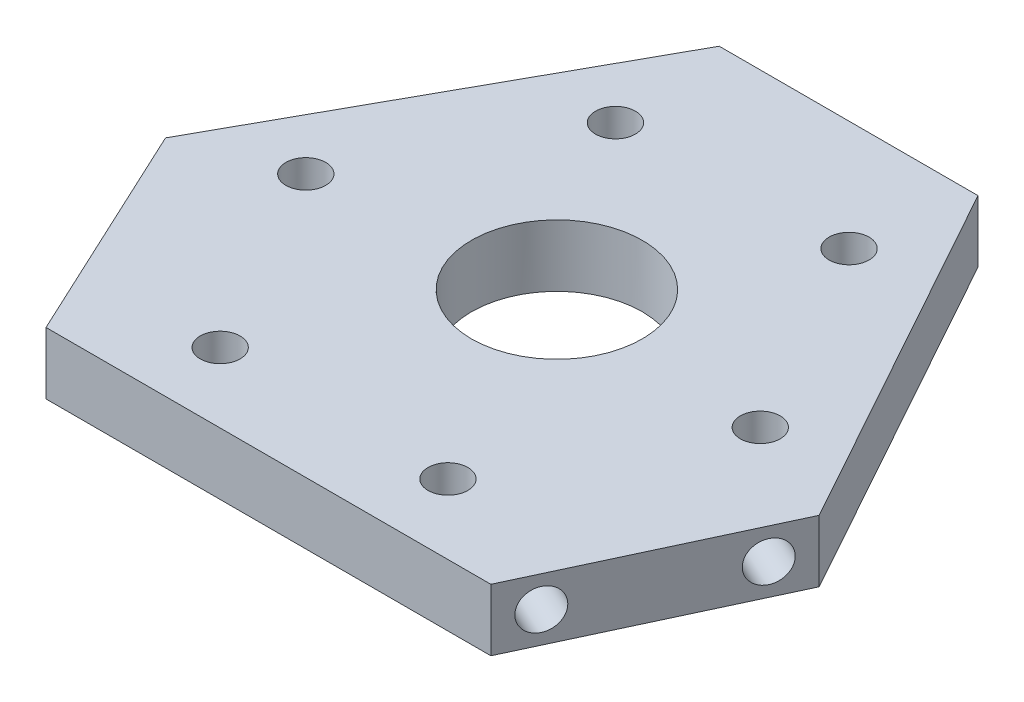
ISO-10303-21;
HEADER;
FILE_DESCRIPTION(('STEP AP214'),'2;1');
FILE_NAME('part.step','',(''),(''),'','','');
FILE_SCHEMA(('AUTOMOTIVE_DESIGN { 1 0 10303 214 1 1 1 1 }'));
ENDSEC;
DATA;
#1=APPLICATION_CONTEXT('core data for automotive mechanical design processes');
#2=APPLICATION_PROTOCOL_DEFINITION('international standard','automotive_design',2000,#1);
#3=PRODUCT_CONTEXT('',#1,'mechanical');
#4=PRODUCT('Part','Part','',(#3));
#5=PRODUCT_RELATED_PRODUCT_CATEGORY('part','',(#4));
#6=PRODUCT_DEFINITION_FORMATION('','',#4);
#7=PRODUCT_DEFINITION_CONTEXT('part definition',#1,'design');
#8=PRODUCT_DEFINITION('design','',#6,#7);
#9=PRODUCT_DEFINITION_SHAPE('','',#8);
#10=(LENGTH_UNIT() NAMED_UNIT(*) SI_UNIT(.MILLI.,.METRE.));
#11=(NAMED_UNIT(*) PLANE_ANGLE_UNIT() SI_UNIT($,.RADIAN.));
#12=(NAMED_UNIT(*) SI_UNIT($,.STERADIAN.) SOLID_ANGLE_UNIT());
#13=UNCERTAINTY_MEASURE_WITH_UNIT(LENGTH_MEASURE(1.E-05),#10,'distance_accuracy_value','');
#14=(GEOMETRIC_REPRESENTATION_CONTEXT(3) GLOBAL_UNCERTAINTY_ASSIGNED_CONTEXT((#13)) GLOBAL_UNIT_ASSIGNED_CONTEXT((#10,
#11,#12)) REPRESENTATION_CONTEXT('',''));
#15=CARTESIAN_POINT('',(0.,0.,0.));
#16=DIRECTION('',(0.,0.,1.));
#17=DIRECTION('',(1.,0.,0.));
#18=AXIS2_PLACEMENT_3D('',#15,#16,#17);
#19=CARTESIAN_POINT('',(6.10164723280824,6.0125,-4.93706927111017));
#20=DIRECTION('',(0.906307787036648,0.,-0.422618261740704));
#21=DIRECTION('',(-0.422618261740704,0.,-0.906307787036648));
#22=AXIS2_PLACEMENT_3D('',#19,#20,#21);
#23=PLANE('',#22);
#24=CARTESIAN_POINT('',(4.41117418584543,3.2525,-8.56230041925676));
#25=DIRECTION('',(-0.906307787036648,0.,0.422618261740704));
#26=DIRECTION('',(0.422618261740704,0.,0.906307787036648));
#27=AXIS2_PLACEMENT_3D('',#24,#25,#26);
#28=CIRCLE('',#27,2.1);
#29=CARTESIAN_POINT('',(5.29867253550091,3.2525,-6.6590540664798));
#30=VERTEX_POINT('',#29);
#31=EDGE_CURVE('E182',#30,#30,#28,.T.);
#32=ORIENTED_EDGE('',*,*,#31,.F.);
#33=EDGE_LOOP('',(#32));
#34=FACE_BOUND('',#33,.T.);
#35=CARTESIAN_POINT('',(-3.21045183401008,3.2525,-24.9069301643724));
#36=DIRECTION('',(-0.906307787036648,0.,0.422618261740704));
#37=DIRECTION('',(0.422618261740704,0.,0.906307787036648));
#38=AXIS2_PLACEMENT_3D('',#35,#36,#37);
#39=CIRCLE('',#38,2.1);
#40=CARTESIAN_POINT('',(-2.3229534843546,3.2525,-23.0036838115955));
#41=VERTEX_POINT('',#40);
#42=EDGE_CURVE('E188',#41,#41,#39,.T.);
#43=ORIENTED_EDGE('',*,*,#42,.F.);
#44=EDGE_LOOP('',(#43));
#45=FACE_BOUND('',#44,.T.);
#46=DIRECTION('',(0.,-1.,0.));
#47=VECTOR('',#46,1.);
#48=CARTESIAN_POINT('',(-4.9009248809729,6.0125,-28.532161312519));
#49=LINE('',#48,#47);
#50=CARTESIAN_POINT('',(-4.9009248809729,6.5125,-28.532161312519));
#51=VERTEX_POINT('',#50);
#52=CARTESIAN_POINT('',(-4.9009248809729,-0.0125000000000001,-28.532161312519));
#53=VERTEX_POINT('',#52);
#54=EDGE_CURVE('E100',#51,#53,#49,.T.);
#55=ORIENTED_EDGE('',*,*,#54,.T.);
#56=DIRECTION('',(-0.422618261740704,0.,-0.906307787036648));
#57=VECTOR('',#56,1.);
#58=CARTESIAN_POINT('',(6.10164723280824,-0.0125000000000001,-4.93706927111017));
#59=LINE('',#58,#57);
#60=CARTESIAN_POINT('',(6.10164723280824,-0.0125000000000001,-4.93706927111017));
#61=VERTEX_POINT('',#60);
#62=EDGE_CURVE('E99',#61,#53,#59,.T.);
#63=ORIENTED_EDGE('',*,*,#62,.F.);
#64=DIRECTION('',(0.,-1.,0.));
#65=VECTOR('',#64,1.);
#66=CARTESIAN_POINT('',(6.10164723280824,6.0125,-4.93706927111017));
#67=LINE('',#66,#65);
#68=CARTESIAN_POINT('',(6.10164723280824,6.5125,-4.93706927111017));
#69=VERTEX_POINT('',#68);
#70=EDGE_CURVE('E11',#69,#61,#67,.T.);
#71=ORIENTED_EDGE('',*,*,#70,.F.);
#72=DIRECTION('',(0.422618261740704,0.,0.906307787036648));
#73=VECTOR('',#72,1.);
#74=CARTESIAN_POINT('',(-4.9009248809729,6.5125,-28.532161312519));
#75=LINE('',#74,#73);
#76=EDGE_CURVE('E150',#51,#69,#75,.T.);
#77=ORIENTED_EDGE('',*,*,#76,.F.);
#78=EDGE_LOOP('',(#55,#63,#71,#77));
#79=FACE_BOUND('',#78,.T.);
#80=ADVANCED_FACE('F36',(#34,#45,#79),#23,.F.);
#81=CARTESIAN_POINT('',(6.10164723280824,6.0125,-4.93706927111017));
#82=DIRECTION('',(0.,0.,-1.));
#83=DIRECTION('',(-1.,0.,0.));
#84=AXIS2_PLACEMENT_3D('',#81,#82,#83);
#85=PLANE('',#84);
#86=ORIENTED_EDGE('',*,*,#70,.T.);
#87=DIRECTION('',(-1.,0.,0.));
#88=VECTOR('',#87,1.);
#89=CARTESIAN_POINT('',(52.9754566450042,-0.0125000000000001,-4.93706927111017));
#90=LINE('',#89,#88);
#91=CARTESIAN_POINT('',(52.9754566450042,-0.0125000000000001,-4.93706927111017));
#92=VERTEX_POINT('',#91);
#93=EDGE_CURVE('E92',#92,#61,#90,.T.);
#94=ORIENTED_EDGE('',*,*,#93,.F.);
#95=DIRECTION('',(0.,-1.,0.));
#96=VECTOR('',#95,1.);
#97=CARTESIAN_POINT('',(52.9754566450042,6.0125,-4.93706927111017));
#98=LINE('',#97,#96);
#99=CARTESIAN_POINT('',(52.9754566450042,6.5125,-4.93706927111017));
#100=VERTEX_POINT('',#99);
#101=EDGE_CURVE('E43',#100,#92,#98,.T.);
#102=ORIENTED_EDGE('',*,*,#101,.F.);
#103=DIRECTION('',(1.,0.,0.));
#104=VECTOR('',#103,1.);
#105=CARTESIAN_POINT('',(6.10164723280824,6.5125,-4.93706927111017));
#106=LINE('',#105,#104);
#107=EDGE_CURVE('E94',#69,#100,#106,.T.);
#108=ORIENTED_EDGE('',*,*,#107,.F.);
#109=EDGE_LOOP('',(#86,#94,#102,#108));
#110=FACE_BOUND('',#109,.T.);
#111=ADVANCED_FACE('F90',(#110),#85,.F.);
#112=CARTESIAN_POINT('',(52.9754566450042,6.0125,-4.93706927111017));
#113=DIRECTION('',(-0.906307787036648,0.,-0.422618261740704));
#114=DIRECTION('',(-0.422618261740704,0.,0.906307787036648));
#115=AXIS2_PLACEMENT_3D('',#112,#113,#114);
#116=PLANE('',#115);
#117=CARTESIAN_POINT('',(62.2875557118226,3.2525,-24.9069301643724));
#118=DIRECTION('',(0.906307787036648,0.,0.422618261740704));
#119=DIRECTION('',(0.422618261740704,0.,-0.906307787036648));
#120=AXIS2_PLACEMENT_3D('',#117,#118,#119);
#121=CIRCLE('',#120,2.1);
#122=CARTESIAN_POINT('',(63.1750540614781,3.2525,-26.8101765171494));
#123=VERTEX_POINT('',#122);
#124=EDGE_CURVE('E160',#123,#123,#121,.T.);
#125=ORIENTED_EDGE('',*,*,#124,.F.);
#126=EDGE_LOOP('',(#125));
#127=FACE_BOUND('',#126,.T.);
#128=CARTESIAN_POINT('',(54.6659296919671,3.2525,-8.56230041925675));
#129=DIRECTION('',(0.906307787036648,0.,0.422618261740704));
#130=DIRECTION('',(0.422618261740704,0.,-0.906307787036648));
#131=AXIS2_PLACEMENT_3D('',#128,#129,#130);
#132=CIRCLE('',#131,2.09999999999998);
#133=CARTESIAN_POINT('',(55.5534280416225,3.2525,-10.4655467720337));
#134=VERTEX_POINT('',#133);
#135=EDGE_CURVE('E164',#134,#134,#132,.T.);
#136=ORIENTED_EDGE('',*,*,#135,.F.);
#137=EDGE_LOOP('',(#136));
#138=FACE_BOUND('',#137,.T.);
#139=ORIENTED_EDGE('',*,*,#101,.T.);
#140=DIRECTION('',(-0.422618261740704,0.,0.906307787036648));
#141=VECTOR('',#140,1.);
#142=CARTESIAN_POINT('',(63.9780287587854,-0.0125000000000001,-28.532161312519));
#143=LINE('',#142,#141);
#144=CARTESIAN_POINT('',(63.9780287587854,-0.0125000000000001,-28.532161312519));
#145=VERTEX_POINT('',#144);
#146=EDGE_CURVE('E111',#145,#92,#143,.T.);
#147=ORIENTED_EDGE('',*,*,#146,.F.);
#148=DIRECTION('',(0.,-1.,0.));
#149=VECTOR('',#148,1.);
#150=CARTESIAN_POINT('',(63.9780287587854,6.0125,-28.532161312519));
#151=LINE('',#150,#149);
#152=CARTESIAN_POINT('',(63.9780287587854,6.5125,-28.532161312519));
#153=VERTEX_POINT('',#152);
#154=EDGE_CURVE('E199',#153,#145,#151,.T.);
#155=ORIENTED_EDGE('',*,*,#154,.F.);
#156=DIRECTION('',(0.422618261740704,0.,-0.906307787036648));
#157=VECTOR('',#156,1.);
#158=CARTESIAN_POINT('',(52.9754566450042,6.5125,-4.93706927111017));
#159=LINE('',#158,#157);
#160=EDGE_CURVE('E153',#100,#153,#159,.T.);
#161=ORIENTED_EDGE('',*,*,#160,.F.);
#162=EDGE_LOOP('',(#139,#147,#155,#161));
#163=FACE_BOUND('',#162,.T.);
#164=ADVANCED_FACE('F202',(#127,#138,#163),#116,.F.);
#165=CARTESIAN_POINT('',(43.1715833101727,6.0125,-66.0679825192663));
#166=DIRECTION('',(-0.874619707139397,0.,0.484809620246335));
#167=DIRECTION('',(0.484809620246335,0.,0.874619707139397));
#168=AXIS2_PLACEMENT_3D('',#165,#166,#167);
#169=PLANE('',#168);
#170=ORIENTED_EDGE('',*,*,#154,.T.);
#171=DIRECTION('',(0.484809620246335,0.,0.874619707139397));
#172=VECTOR('',#171,1.);
#173=CARTESIAN_POINT('',(43.1715833101727,-0.0125000000000001,-66.0679825192663));
#174=LINE('',#173,#172);
#175=CARTESIAN_POINT('',(43.1715833101727,-0.0125000000000001,-66.0679825192663));
#176=VERTEX_POINT('',#175);
#177=EDGE_CURVE('E123',#176,#145,#174,.T.);
#178=ORIENTED_EDGE('',*,*,#177,.F.);
#179=DIRECTION('',(0.,-1.,0.));
#180=VECTOR('',#179,1.);
#181=CARTESIAN_POINT('',(43.1715833101727,6.0125,-66.0679825192663));
#182=LINE('',#181,#180);
#183=CARTESIAN_POINT('',(43.1715833101727,6.5125,-66.0679825192663));
#184=VERTEX_POINT('',#183);
#185=EDGE_CURVE('E58',#184,#176,#182,.T.);
#186=ORIENTED_EDGE('',*,*,#185,.F.);
#187=DIRECTION('',(-0.484809620246335,0.,-0.874619707139397));
#188=VECTOR('',#187,1.);
#189=CARTESIAN_POINT('',(63.9780287587854,6.5125,-28.532161312519));
#190=LINE('',#189,#188);
#191=EDGE_CURVE('E156',#153,#184,#190,.T.);
#192=ORIENTED_EDGE('',*,*,#191,.F.);
#193=EDGE_LOOP('',(#170,#178,#186,#192));
#194=FACE_BOUND('',#193,.T.);
#195=ADVANCED_FACE('F211',(#194),#169,.F.);
#196=CARTESIAN_POINT('',(15.9055205676398,6.0125,-66.0679825192663));
#197=DIRECTION('',(0.,0.,1.));
#198=DIRECTION('',(1.,0.,0.));
#199=AXIS2_PLACEMENT_3D('',#196,#197,#198);
#200=PLANE('',#199);
#201=CARTESIAN_POINT('',(19.9055205676398,3.2525,-66.0679825192663));
#202=DIRECTION('',(0.,0.,-1.));
#203=DIRECTION('',(-1.,0.,0.));
#204=AXIS2_PLACEMENT_3D('',#201,#202,#203);
#205=CIRCLE('',#204,2.1);
#206=CARTESIAN_POINT('',(17.8055205676398,3.2525,-66.0679825192663));
#207=VERTEX_POINT('',#206);
#208=EDGE_CURVE('E170',#207,#207,#205,.T.);
#209=ORIENTED_EDGE('',*,*,#208,.F.);
#210=EDGE_LOOP('',(#209));
#211=FACE_BOUND('',#210,.T.);
#212=CARTESIAN_POINT('',(39.1715833101727,3.2525,-66.0679825192663));
#213=DIRECTION('',(0.,0.,-1.));
#214=DIRECTION('',(-1.,0.,0.));
#215=AXIS2_PLACEMENT_3D('',#212,#213,#214);
#216=CIRCLE('',#215,2.1);
#217=CARTESIAN_POINT('',(37.0715833101727,3.2525,-66.0679825192663));
#218=VERTEX_POINT('',#217);
#219=EDGE_CURVE('E176',#218,#218,#216,.T.);
#220=ORIENTED_EDGE('',*,*,#219,.F.);
#221=EDGE_LOOP('',(#220));
#222=FACE_BOUND('',#221,.T.);
#223=ORIENTED_EDGE('',*,*,#185,.T.);
#224=DIRECTION('',(1.,0.,0.));
#225=VECTOR('',#224,1.);
#226=CARTESIAN_POINT('',(15.9055205676398,-0.0125000000000001,-66.0679825192663));
#227=LINE('',#226,#225);
#228=CARTESIAN_POINT('',(15.9055205676398,-0.0125000000000001,-66.0679825192663));
#229=VERTEX_POINT('',#228);
#230=EDGE_CURVE('E120',#229,#176,#227,.T.);
#231=ORIENTED_EDGE('',*,*,#230,.F.);
#232=DIRECTION('',(0.,-1.,0.));
#233=VECTOR('',#232,1.);
#234=CARTESIAN_POINT('',(15.9055205676398,6.0125,-66.0679825192663));
#235=LINE('',#234,#233);
#236=CARTESIAN_POINT('',(15.9055205676398,6.5125,-66.0679825192663));
#237=VERTEX_POINT('',#236);
#238=EDGE_CURVE('E50',#237,#229,#235,.T.);
#239=ORIENTED_EDGE('',*,*,#238,.F.);
#240=DIRECTION('',(-1.,0.,0.));
#241=VECTOR('',#240,1.);
#242=CARTESIAN_POINT('',(43.1715833101727,6.5125,-66.0679825192663));
#243=LINE('',#242,#241);
#244=EDGE_CURVE('E158',#184,#237,#243,.T.);
#245=ORIENTED_EDGE('',*,*,#244,.F.);
#246=EDGE_LOOP('',(#223,#231,#239,#245));
#247=FACE_BOUND('',#246,.T.);
#248=ADVANCED_FACE('F209',(#211,#222,#247),#200,.F.);
#249=CARTESIAN_POINT('',(-4.9009248809729,6.0125,-28.532161312519));
#250=DIRECTION('',(0.874619707139397,0.,0.484809620246335));
#251=DIRECTION('',(0.484809620246335,0.,-0.874619707139397));
#252=AXIS2_PLACEMENT_3D('',#249,#250,#251);
#253=PLANE('',#252);
#254=ORIENTED_EDGE('',*,*,#238,.T.);
#255=DIRECTION('',(0.484809620246335,0.,-0.874619707139397));
#256=VECTOR('',#255,1.);
#257=CARTESIAN_POINT('',(-4.9009248809729,-0.0125000000000001,-28.532161312519));
#258=LINE('',#257,#256);
#259=EDGE_CURVE('E104',#53,#229,#258,.T.);
#260=ORIENTED_EDGE('',*,*,#259,.F.);
#261=ORIENTED_EDGE('',*,*,#54,.F.);
#262=DIRECTION('',(-0.484809620246335,0.,0.874619707139397));
#263=VECTOR('',#262,1.);
#264=CARTESIAN_POINT('',(15.9055205676398,6.5125,-66.0679825192663));
#265=LINE('',#264,#263);
#266=EDGE_CURVE('E147',#237,#51,#265,.T.);
#267=ORIENTED_EDGE('',*,*,#266,.F.);
#268=EDGE_LOOP('',(#254,#260,#261,#267));
#269=FACE_BOUND('',#268,.T.);
#270=ADVANCED_FACE('F208',(#269),#253,.F.);
#271=CARTESIAN_POINT('',(29.5610287587854,-3.9875,-35.3073480142442));
#272=DIRECTION('',(0.,1.,0.));
#273=DIRECTION('',(0.,0.,1.));
#274=AXIS2_PLACEMENT_3D('',#271,#272,#273);
#275=CYLINDRICAL_SURFACE('',#274,9.);
#276=CARTESIAN_POINT('',(29.5610287587854,6.5125,-35.3073480142442));
#277=DIRECTION('',(0.,1.,0.));
#278=DIRECTION('',(0.,0.,1.));
#279=AXIS2_PLACEMENT_3D('',#276,#277,#278);
#280=CIRCLE('',#279,9.);
#281=CARTESIAN_POINT('',(29.5610287587854,6.5125,-26.3073480142442));
#282=VERTEX_POINT('',#281);
#283=EDGE_CURVE('E138',#282,#282,#280,.T.);
#284=ORIENTED_EDGE('',*,*,#283,.T.);
#285=EDGE_LOOP('',(#284));
#286=FACE_BOUND('',#285,.T.);
#287=CARTESIAN_POINT('',(29.5610287587854,-0.0125000000000001,-35.3073480142442));
#288=DIRECTION('',(0.,-1.,0.));
#289=DIRECTION('',(0.,0.,-1.));
#290=AXIS2_PLACEMENT_3D('',#287,#288,#289);
#291=CIRCLE('',#290,9.);
#292=CARTESIAN_POINT('',(29.5610287587854,-0.0125000000000001,-44.3073480142442));
#293=VERTEX_POINT('',#292);
#294=EDGE_CURVE('E334',#293,#293,#291,.T.);
#295=ORIENTED_EDGE('',*,*,#294,.T.);
#296=EDGE_LOOP('',(#295));
#297=FACE_BOUND('',#296,.T.);
#298=ADVANCED_FACE('F218',(#286,#297),#275,.F.);
#299=CARTESIAN_POINT('',(2.2273948882098,3.2525,-27.4426397348166));
#300=DIRECTION('',(-0.906307787036648,0.,0.422618261740704));
#301=DIRECTION('',(0.422618261740704,0.,0.906307787036648));
#302=AXIS2_PLACEMENT_3D('',#299,#300,#301);
#303=CYLINDRICAL_SURFACE('',#302,2.1);
#304=CARTESIAN_POINT('',(2.2273948882098,3.2525,-27.4426397348166));
#305=DIRECTION('',(-0.906307787036648,0.,0.422618261740704));
#306=DIRECTION('',(0.422618261740704,0.,0.906307787036648));
#307=AXIS2_PLACEMENT_3D('',#304,#305,#306);
#308=CIRCLE('',#307,2.1);
#309=CARTESIAN_POINT('',(3.11489323786528,3.2525,-25.5393933820397));
#310=VERTEX_POINT('',#309);
#311=EDGE_CURVE('E191',#310,#310,#308,.T.);
#312=ORIENTED_EDGE('',*,*,#311,.F.);
#313=EDGE_LOOP('',(#312));
#314=FACE_BOUND('',#313,.T.);
#315=ORIENTED_EDGE('',*,*,#42,.T.);
#316=EDGE_LOOP('',(#315));
#317=FACE_BOUND('',#316,.T.);
#318=ADVANCED_FACE('F232',(#314,#317),#303,.F.);
#319=CARTESIAN_POINT('',(2.2273948882098,3.2525,-27.4426397348166));
#320=DIRECTION('',(-0.906307787036648,0.,0.422618261740704));
#321=DIRECTION('',(0.422618261740704,0.,0.906307787036648));
#322=AXIS2_PLACEMENT_3D('',#319,#320,#321);
#323=PLANE('',#322);
#324=ORIENTED_EDGE('',*,*,#311,.T.);
#325=EDGE_LOOP('',(#324));
#326=FACE_BOUND('',#325,.T.);
#327=ADVANCED_FACE('F234',(#326),#323,.T.);
#328=CARTESIAN_POINT('',(9.84902090806531,3.2525,-11.098009989701));
#329=DIRECTION('',(-0.906307787036648,0.,0.422618261740704));
#330=DIRECTION('',(0.422618261740704,0.,0.906307787036648));
#331=AXIS2_PLACEMENT_3D('',#328,#329,#330);
#332=CYLINDRICAL_SURFACE('',#331,2.1);
#333=CARTESIAN_POINT('',(9.84902090806531,3.2525,-11.098009989701));
#334=DIRECTION('',(-0.906307787036648,0.,0.422618261740704));
#335=DIRECTION('',(0.422618261740704,0.,0.906307787036648));
#336=AXIS2_PLACEMENT_3D('',#333,#334,#335);
#337=CIRCLE('',#336,2.1);
#338=CARTESIAN_POINT('',(10.7365192577208,3.2525,-9.19476363692402));
#339=VERTEX_POINT('',#338);
#340=EDGE_CURVE('E185',#339,#339,#337,.T.);
#341=ORIENTED_EDGE('',*,*,#340,.F.);
#342=EDGE_LOOP('',(#341));
#343=FACE_BOUND('',#342,.T.);
#344=ORIENTED_EDGE('',*,*,#31,.T.);
#345=EDGE_LOOP('',(#344));
#346=FACE_BOUND('',#345,.T.);
#347=ADVANCED_FACE('F241',(#343,#346),#332,.F.);
#348=CARTESIAN_POINT('',(9.84902090806531,3.2525,-11.098009989701));
#349=DIRECTION('',(-0.906307787036648,0.,0.422618261740704));
#350=DIRECTION('',(0.422618261740704,0.,0.906307787036648));
#351=AXIS2_PLACEMENT_3D('',#348,#349,#350);
#352=PLANE('',#351);
#353=ORIENTED_EDGE('',*,*,#340,.T.);
#354=EDGE_LOOP('',(#353));
#355=FACE_BOUND('',#354,.T.);
#356=ADVANCED_FACE('F250',(#355),#352,.T.);
#357=CARTESIAN_POINT('',(39.1715833101727,3.2525,-60.0679825192663));
#358=DIRECTION('',(0.,0.,-1.));
#359=DIRECTION('',(-1.,0.,0.));
#360=AXIS2_PLACEMENT_3D('',#357,#358,#359);
#361=CYLINDRICAL_SURFACE('',#360,2.1);
#362=CARTESIAN_POINT('',(39.1715833101727,3.2525,-60.0679825192663));
#363=DIRECTION('',(0.,0.,-1.));
#364=DIRECTION('',(-1.,0.,0.));
#365=AXIS2_PLACEMENT_3D('',#362,#363,#364);
#366=CIRCLE('',#365,2.1);
#367=CARTESIAN_POINT('',(37.0715833101727,3.2525,-60.0679825192663));
#368=VERTEX_POINT('',#367);
#369=EDGE_CURVE('E179',#368,#368,#366,.T.);
#370=ORIENTED_EDGE('',*,*,#369,.F.);
#371=EDGE_LOOP('',(#370));
#372=FACE_BOUND('',#371,.T.);
#373=ORIENTED_EDGE('',*,*,#219,.T.);
#374=EDGE_LOOP('',(#373));
#375=FACE_BOUND('',#374,.T.);
#376=ADVANCED_FACE('F254',(#372,#375),#361,.F.);
#377=CARTESIAN_POINT('',(39.1715833101727,3.2525,-60.0679825192663));
#378=DIRECTION('',(0.,0.,-1.));
#379=DIRECTION('',(-1.,0.,0.));
#380=AXIS2_PLACEMENT_3D('',#377,#378,#379);
#381=PLANE('',#380);
#382=ORIENTED_EDGE('',*,*,#369,.T.);
#383=EDGE_LOOP('',(#382));
#384=FACE_BOUND('',#383,.T.);
#385=ADVANCED_FACE('F258',(#384),#381,.T.);
#386=CARTESIAN_POINT('',(19.9055205676398,3.2525,-60.0679825192663));
#387=DIRECTION('',(0.,0.,-1.));
#388=DIRECTION('',(-1.,0.,0.));
#389=AXIS2_PLACEMENT_3D('',#386,#387,#388);
#390=CYLINDRICAL_SURFACE('',#389,2.1);
#391=CARTESIAN_POINT('',(19.9055205676398,3.2525,-60.0679825192663));
#392=DIRECTION('',(0.,0.,-1.));
#393=DIRECTION('',(-1.,0.,0.));
#394=AXIS2_PLACEMENT_3D('',#391,#392,#393);
#395=CIRCLE('',#394,2.1);
#396=CARTESIAN_POINT('',(17.8055205676398,3.2525,-60.0679825192663));
#397=VERTEX_POINT('',#396);
#398=EDGE_CURVE('E173',#397,#397,#395,.T.);
#399=ORIENTED_EDGE('',*,*,#398,.F.);
#400=EDGE_LOOP('',(#399));
#401=FACE_BOUND('',#400,.T.);
#402=ORIENTED_EDGE('',*,*,#208,.T.);
#403=EDGE_LOOP('',(#402));
#404=FACE_BOUND('',#403,.T.);
#405=ADVANCED_FACE('F262',(#401,#404),#390,.F.);
#406=CARTESIAN_POINT('',(19.9055205676398,3.2525,-60.0679825192663));
#407=DIRECTION('',(0.,0.,-1.));
#408=DIRECTION('',(-1.,0.,0.));
#409=AXIS2_PLACEMENT_3D('',#406,#407,#408);
#410=PLANE('',#409);
#411=ORIENTED_EDGE('',*,*,#398,.T.);
#412=EDGE_LOOP('',(#411));
#413=FACE_BOUND('',#412,.T.);
#414=ADVANCED_FACE('F266',(#413),#410,.T.);
#415=CARTESIAN_POINT('',(49.2280829697472,3.2525,-11.098009989701));
#416=DIRECTION('',(0.906307787036648,0.,0.422618261740704));
#417=DIRECTION('',(0.422618261740704,0.,-0.906307787036648));
#418=AXIS2_PLACEMENT_3D('',#415,#416,#417);
#419=CYLINDRICAL_SURFACE('',#418,2.09999999999998);
#420=CARTESIAN_POINT('',(49.2280829697472,3.2525,-11.098009989701));
#421=DIRECTION('',(0.906307787036648,0.,0.422618261740704));
#422=DIRECTION('',(0.422618261740704,0.,-0.906307787036648));
#423=AXIS2_PLACEMENT_3D('',#420,#421,#422);
#424=CIRCLE('',#423,2.09999999999998);
#425=CARTESIAN_POINT('',(50.1155813194027,3.2525,-13.0012563424779));
#426=VERTEX_POINT('',#425);
#427=EDGE_CURVE('E167',#426,#426,#424,.T.);
#428=ORIENTED_EDGE('',*,*,#427,.F.);
#429=EDGE_LOOP('',(#428));
#430=FACE_BOUND('',#429,.T.);
#431=ORIENTED_EDGE('',*,*,#135,.T.);
#432=EDGE_LOOP('',(#431));
#433=FACE_BOUND('',#432,.T.);
#434=ADVANCED_FACE('F270',(#430,#433),#419,.F.);
#435=CARTESIAN_POINT('',(49.2280829697472,3.2525,-11.098009989701));
#436=DIRECTION('',(0.906307787036648,0.,0.422618261740704));
#437=DIRECTION('',(0.422618261740704,0.,-0.906307787036648));
#438=AXIS2_PLACEMENT_3D('',#435,#436,#437);
#439=PLANE('',#438);
#440=ORIENTED_EDGE('',*,*,#427,.T.);
#441=EDGE_LOOP('',(#440));
#442=FACE_BOUND('',#441,.T.);
#443=ADVANCED_FACE('F274',(#442),#439,.T.);
#444=CARTESIAN_POINT('',(56.8497089896027,3.2525,-27.4426397348166));
#445=DIRECTION('',(0.906307787036648,0.,0.422618261740704));
#446=DIRECTION('',(0.422618261740704,0.,-0.906307787036648));
#447=AXIS2_PLACEMENT_3D('',#444,#445,#446);
#448=CYLINDRICAL_SURFACE('',#447,2.1);
#449=CARTESIAN_POINT('',(56.8497089896027,3.2525,-27.4426397348166));
#450=DIRECTION('',(0.906307787036648,0.,0.422618261740704));
#451=DIRECTION('',(0.422618261740704,0.,-0.906307787036648));
#452=AXIS2_PLACEMENT_3D('',#449,#450,#451);
#453=CIRCLE('',#452,2.1);
#454=CARTESIAN_POINT('',(57.7372073392582,3.2525,-29.3458860875936));
#455=VERTEX_POINT('',#454);
#456=EDGE_CURVE('E161',#455,#455,#453,.T.);
#457=ORIENTED_EDGE('',*,*,#456,.F.);
#458=EDGE_LOOP('',(#457));
#459=FACE_BOUND('',#458,.T.);
#460=ORIENTED_EDGE('',*,*,#124,.T.);
#461=EDGE_LOOP('',(#460));
#462=FACE_BOUND('',#461,.T.);
#463=ADVANCED_FACE('F278',(#459,#462),#448,.F.);
#464=CARTESIAN_POINT('',(56.8497089896027,3.2525,-27.4426397348166));
#465=DIRECTION('',(0.906307787036648,0.,0.422618261740704));
#466=DIRECTION('',(0.422618261740704,0.,-0.906307787036648));
#467=AXIS2_PLACEMENT_3D('',#464,#465,#466);
#468=PLANE('',#467);
#469=ORIENTED_EDGE('',*,*,#456,.T.);
#470=EDGE_LOOP('',(#469));
#471=FACE_BOUND('',#470,.T.);
#472=ADVANCED_FACE('F282',(#471),#468,.T.);
#473=CARTESIAN_POINT('',(41.2114897090094,10.4875,-54.4434947343061));
#474=DIRECTION('',(0.,-1.,0.));
#475=DIRECTION('',(0.,0.,-1.));
#476=AXIS2_PLACEMENT_3D('',#473,#474,#475);
#477=CYLINDRICAL_SURFACE('',#476,2.1);
#478=CARTESIAN_POINT('',(41.2114897090094,6.5125,-54.4434947343061));
#479=DIRECTION('',(0.,1.,0.));
#480=DIRECTION('',(0.,0.,1.));
#481=AXIS2_PLACEMENT_3D('',#478,#479,#480);
#482=CIRCLE('',#481,2.1);
#483=CARTESIAN_POINT('',(41.2114897090094,6.5125,-52.3434947343061));
#484=VERTEX_POINT('',#483);
#485=EDGE_CURVE('E141',#484,#484,#482,.T.);
#486=ORIENTED_EDGE('',*,*,#485,.T.);
#487=EDGE_LOOP('',(#486));
#488=FACE_BOUND('',#487,.T.);
#489=CARTESIAN_POINT('',(41.2114897090094,-0.0125000000000001,-54.4434947343061));
#490=DIRECTION('',(0.,-1.,0.));
#491=DIRECTION('',(0.,0.,-1.));
#492=AXIS2_PLACEMENT_3D('',#489,#490,#491);
#493=CIRCLE('',#492,2.1);
#494=CARTESIAN_POINT('',(41.2114897090094,-0.0125000000000001,-56.5434947343061));
#495=VERTEX_POINT('',#494);
#496=EDGE_CURVE('E325',#495,#495,#493,.T.);
#497=ORIENTED_EDGE('',*,*,#496,.T.);
#498=EDGE_LOOP('',(#497));
#499=FACE_BOUND('',#498,.T.);
#500=ADVANCED_FACE('F286',(#488,#499),#477,.F.);
#501=CARTESIAN_POINT('',(52.8469205949214,10.4875,-33.4526217629606));
#502=DIRECTION('',(0.,-1.,0.));
#503=DIRECTION('',(0.,0.,-1.));
#504=AXIS2_PLACEMENT_3D('',#501,#502,#503);
#505=CYLINDRICAL_SURFACE('',#504,2.1);
#506=CARTESIAN_POINT('',(52.8469205949214,6.5125,-33.4526217629606));
#507=DIRECTION('',(0.,1.,0.));
#508=DIRECTION('',(0.,0.,1.));
#509=AXIS2_PLACEMENT_3D('',#506,#507,#508);
#510=CIRCLE('',#509,2.1);
#511=CARTESIAN_POINT('',(52.8469205949214,6.5125,-31.3526217629606));
#512=VERTEX_POINT('',#511);
#513=EDGE_CURVE('E129',#512,#512,#510,.T.);
#514=ORIENTED_EDGE('',*,*,#513,.T.);
#515=EDGE_LOOP('',(#514));
#516=FACE_BOUND('',#515,.T.);
#517=CARTESIAN_POINT('',(52.8469205949214,-0.0125000000000001,-33.4526217629606));
#518=DIRECTION('',(0.,-1.,0.));
#519=DIRECTION('',(0.,0.,-1.));
#520=AXIS2_PLACEMENT_3D('',#517,#518,#519);
#521=CIRCLE('',#520,2.1);
#522=CARTESIAN_POINT('',(52.8469205949214,-0.0125000000000001,-35.5526217629606));
#523=VERTEX_POINT('',#522);
#524=EDGE_CURVE('E321',#523,#523,#521,.T.);
#525=ORIENTED_EDGE('',*,*,#524,.T.);
#526=EDGE_LOOP('',(#525));
#527=FACE_BOUND('',#526,.T.);
#528=ADVANCED_FACE('F290',(#516,#527),#505,.F.);
#529=CARTESIAN_POINT('',(17.4131577696141,10.4875,-53.6272417829909));
#530=DIRECTION('',(0.,-1.,0.));
#531=DIRECTION('',(0.,0.,-1.));
#532=AXIS2_PLACEMENT_3D('',#529,#530,#531);
#533=CYLINDRICAL_SURFACE('',#532,2.1);
#534=CARTESIAN_POINT('',(17.4131577696141,6.5125,-53.6272417829909));
#535=DIRECTION('',(0.,1.,0.));
#536=DIRECTION('',(0.,0.,1.));
#537=AXIS2_PLACEMENT_3D('',#534,#535,#536);
#538=CIRCLE('',#537,2.1);
#539=CARTESIAN_POINT('',(17.4131577696141,6.5125,-51.5272417829909));
#540=VERTEX_POINT('',#539);
#541=EDGE_CURVE('E126',#540,#540,#538,.T.);
#542=ORIENTED_EDGE('',*,*,#541,.T.);
#543=EDGE_LOOP('',(#542));
#544=FACE_BOUND('',#543,.T.);
#545=CARTESIAN_POINT('',(17.4131577696141,-0.0125000000000001,-53.6272417829909));
#546=DIRECTION('',(0.,-1.,0.));
#547=DIRECTION('',(0.,0.,-1.));
#548=AXIS2_PLACEMENT_3D('',#545,#546,#547);
#549=CIRCLE('',#548,2.1);
#550=CARTESIAN_POINT('',(17.4131577696141,-0.0125000000000001,-55.7272417829909));
#551=VERTEX_POINT('',#550);
#552=EDGE_CURVE('E338',#551,#551,#549,.T.);
#553=ORIENTED_EDGE('',*,*,#552,.T.);
#554=EDGE_LOOP('',(#553));
#555=FACE_BOUND('',#554,.T.);
#556=ADVANCED_FACE('F292',(#544,#555),#533,.F.);
#557=CARTESIAN_POINT('',(5.77772688370205,10.4875,-32.6363688116453));
#558=DIRECTION('',(0.,-1.,0.));
#559=DIRECTION('',(0.,0.,-1.));
#560=AXIS2_PLACEMENT_3D('',#557,#558,#559);
#561=CYLINDRICAL_SURFACE('',#560,2.1);
#562=CARTESIAN_POINT('',(5.77772688370205,6.5125,-32.6363688116453));
#563=DIRECTION('',(0.,1.,0.));
#564=DIRECTION('',(0.,0.,1.));
#565=AXIS2_PLACEMENT_3D('',#562,#563,#564);
#566=CIRCLE('',#565,2.1);
#567=CARTESIAN_POINT('',(5.77772688370205,6.5125,-30.5363688116453));
#568=VERTEX_POINT('',#567);
#569=EDGE_CURVE('E135',#568,#568,#566,.T.);
#570=ORIENTED_EDGE('',*,*,#569,.T.);
#571=EDGE_LOOP('',(#570));
#572=FACE_BOUND('',#571,.T.);
#573=CARTESIAN_POINT('',(5.77772688370205,-0.0125000000000001,-32.6363688116453));
#574=DIRECTION('',(0.,-1.,0.));
#575=DIRECTION('',(0.,0.,-1.));
#576=AXIS2_PLACEMENT_3D('',#573,#574,#575);
#577=CIRCLE('',#576,2.1);
#578=CARTESIAN_POINT('',(5.77772688370205,-0.0125000000000001,-34.7363688116453));
#579=VERTEX_POINT('',#578);
#580=EDGE_CURVE('E329',#579,#579,#577,.T.);
#581=ORIENTED_EDGE('',*,*,#580,.T.);
#582=EDGE_LOOP('',(#581));
#583=FACE_BOUND('',#582,.T.);
#584=ADVANCED_FACE('F295',(#572,#583),#561,.F.);
#585=CARTESIAN_POINT('',(17.1016472328083,10.4875,-12.2870692711102));
#586=DIRECTION('',(0.,-1.,0.));
#587=DIRECTION('',(0.,0.,-1.));
#588=AXIS2_PLACEMENT_3D('',#585,#586,#587);
#589=CYLINDRICAL_SURFACE('',#588,2.1);
#590=CARTESIAN_POINT('',(17.1016472328083,6.5125,-12.2870692711102));
#591=DIRECTION('',(0.,1.,0.));
#592=DIRECTION('',(0.,0.,1.));
#593=AXIS2_PLACEMENT_3D('',#590,#591,#592);
#594=CIRCLE('',#593,2.1);
#595=CARTESIAN_POINT('',(17.1016472328083,6.5125,-10.1870692711102));
#596=VERTEX_POINT('',#595);
#597=EDGE_CURVE('E144',#596,#596,#594,.T.);
#598=ORIENTED_EDGE('',*,*,#597,.T.);
#599=EDGE_LOOP('',(#598));
#600=FACE_BOUND('',#599,.T.);
#601=CARTESIAN_POINT('',(17.1016472328083,-0.0125000000000001,-12.2870692711102));
#602=DIRECTION('',(0.,-1.,0.));
#603=DIRECTION('',(0.,0.,-1.));
#604=AXIS2_PLACEMENT_3D('',#601,#602,#603);
#605=CIRCLE('',#604,2.1);
#606=CARTESIAN_POINT('',(17.1016472328083,-0.0125000000000001,-14.3870692711102));
#607=VERTEX_POINT('',#606);
#608=EDGE_CURVE('E115',#607,#607,#605,.T.);
#609=ORIENTED_EDGE('',*,*,#608,.T.);
#610=EDGE_LOOP('',(#609));
#611=FACE_BOUND('',#610,.T.);
#612=ADVANCED_FACE('F303',(#600,#611),#589,.F.);
#613=CARTESIAN_POINT('',(41.1016472328083,10.4875,-12.2870692711102));
#614=DIRECTION('',(0.,-1.,0.));
#615=DIRECTION('',(0.,0.,-1.));
#616=AXIS2_PLACEMENT_3D('',#613,#614,#615);
#617=CYLINDRICAL_SURFACE('',#616,2.1);
#618=CARTESIAN_POINT('',(41.1016472328083,6.5125,-12.2870692711102));
#619=DIRECTION('',(0.,1.,0.));
#620=DIRECTION('',(0.,0.,1.));
#621=AXIS2_PLACEMENT_3D('',#618,#619,#620);
#622=CIRCLE('',#621,2.1);
#623=CARTESIAN_POINT('',(41.1016472328083,6.5125,-10.1870692711102));
#624=VERTEX_POINT('',#623);
#625=EDGE_CURVE('E132',#624,#624,#622,.T.);
#626=ORIENTED_EDGE('',*,*,#625,.T.);
#627=EDGE_LOOP('',(#626));
#628=FACE_BOUND('',#627,.T.);
#629=CARTESIAN_POINT('',(41.1016472328083,-0.0125000000000001,-12.2870692711102));
#630=DIRECTION('',(0.,-1.,0.));
#631=DIRECTION('',(0.,0.,-1.));
#632=AXIS2_PLACEMENT_3D('',#629,#630,#631);
#633=CIRCLE('',#632,2.1);
#634=CARTESIAN_POINT('',(41.1016472328083,-0.0125000000000001,-14.3870692711102));
#635=VERTEX_POINT('',#634);
#636=EDGE_CURVE('E112',#635,#635,#633,.T.);
#637=ORIENTED_EDGE('',*,*,#636,.T.);
#638=EDGE_LOOP('',(#637));
#639=FACE_BOUND('',#638,.T.);
#640=ADVANCED_FACE('F300',(#628,#639),#617,.F.);
#641=CARTESIAN_POINT('',(0.,6.5125,0.));
#642=DIRECTION('',(0.,1.,0.));
#643=DIRECTION('',(0.,0.,1.));
#644=AXIS2_PLACEMENT_3D('',#641,#642,#643);
#645=PLANE('',#644);
#646=ORIENTED_EDGE('',*,*,#513,.F.);
#647=EDGE_LOOP('',(#646));
#648=FACE_BOUND('',#647,.T.);
#649=ORIENTED_EDGE('',*,*,#569,.F.);
#650=EDGE_LOOP('',(#649));
#651=FACE_BOUND('',#650,.T.);
#652=ORIENTED_EDGE('',*,*,#485,.F.);
#653=EDGE_LOOP('',(#652));
#654=FACE_BOUND('',#653,.T.);
#655=ORIENTED_EDGE('',*,*,#266,.T.);
#656=ORIENTED_EDGE('',*,*,#76,.T.);
#657=ORIENTED_EDGE('',*,*,#107,.T.);
#658=ORIENTED_EDGE('',*,*,#160,.T.);
#659=ORIENTED_EDGE('',*,*,#191,.T.);
#660=ORIENTED_EDGE('',*,*,#244,.T.);
#661=EDGE_LOOP('',(#655,#656,#657,#658,#659,#660));
#662=FACE_BOUND('',#661,.T.);
#663=ORIENTED_EDGE('',*,*,#597,.F.);
#664=EDGE_LOOP('',(#663));
#665=FACE_BOUND('',#664,.T.);
#666=ORIENTED_EDGE('',*,*,#283,.F.);
#667=EDGE_LOOP('',(#666));
#668=FACE_BOUND('',#667,.T.);
#669=ORIENTED_EDGE('',*,*,#625,.F.);
#670=EDGE_LOOP('',(#669));
#671=FACE_BOUND('',#670,.T.);
#672=ORIENTED_EDGE('',*,*,#541,.F.);
#673=EDGE_LOOP('',(#672));
#674=FACE_BOUND('',#673,.T.);
#675=ADVANCED_FACE('F204',(#648,#651,#654,#662,#665,#668,#671,#674),#645,.T.);
#676=CARTESIAN_POINT('',(0.,-0.0125000000000001,0.));
#677=DIRECTION('',(0.,-1.,0.));
#678=DIRECTION('',(0.,0.,-1.));
#679=AXIS2_PLACEMENT_3D('',#676,#677,#678);
#680=PLANE('',#679);
#681=ORIENTED_EDGE('',*,*,#524,.F.);
#682=EDGE_LOOP('',(#681));
#683=FACE_BOUND('',#682,.T.);
#684=ORIENTED_EDGE('',*,*,#496,.F.);
#685=EDGE_LOOP('',(#684));
#686=FACE_BOUND('',#685,.T.);
#687=ORIENTED_EDGE('',*,*,#608,.F.);
#688=EDGE_LOOP('',(#687));
#689=FACE_BOUND('',#688,.T.);
#690=ORIENTED_EDGE('',*,*,#93,.T.);
#691=ORIENTED_EDGE('',*,*,#62,.T.);
#692=ORIENTED_EDGE('',*,*,#259,.T.);
#693=ORIENTED_EDGE('',*,*,#230,.T.);
#694=ORIENTED_EDGE('',*,*,#177,.T.);
#695=ORIENTED_EDGE('',*,*,#146,.T.);
#696=EDGE_LOOP('',(#690,#691,#692,#693,#694,#695));
#697=FACE_BOUND('',#696,.T.);
#698=ORIENTED_EDGE('',*,*,#636,.F.);
#699=EDGE_LOOP('',(#698));
#700=FACE_BOUND('',#699,.T.);
#701=ORIENTED_EDGE('',*,*,#580,.F.);
#702=EDGE_LOOP('',(#701));
#703=FACE_BOUND('',#702,.T.);
#704=ORIENTED_EDGE('',*,*,#294,.F.);
#705=EDGE_LOOP('',(#704));
#706=FACE_BOUND('',#705,.T.);
#707=ORIENTED_EDGE('',*,*,#552,.F.);
#708=EDGE_LOOP('',(#707));
#709=FACE_BOUND('',#708,.T.);
#710=ADVANCED_FACE('F107',(#683,#686,#689,#697,#700,#703,#706,#709),#680,.T.);
#711=CLOSED_SHELL('',(#80,#111,#164,#195,#248,#270,#298,#318,#327,#347,#356,#376,#385,#405,#414,
#434,#443,#463,#472,#500,#528,#556,#584,#612,#640,#675,#710));
#712=MANIFOLD_SOLID_BREP('B2',#711);
#713=ADVANCED_BREP_SHAPE_REPRESENTATION('',(#18,#712),#14);
#714=SHAPE_DEFINITION_REPRESENTATION(#9,#713);
ENDSEC;
END-ISO-10303-21;
